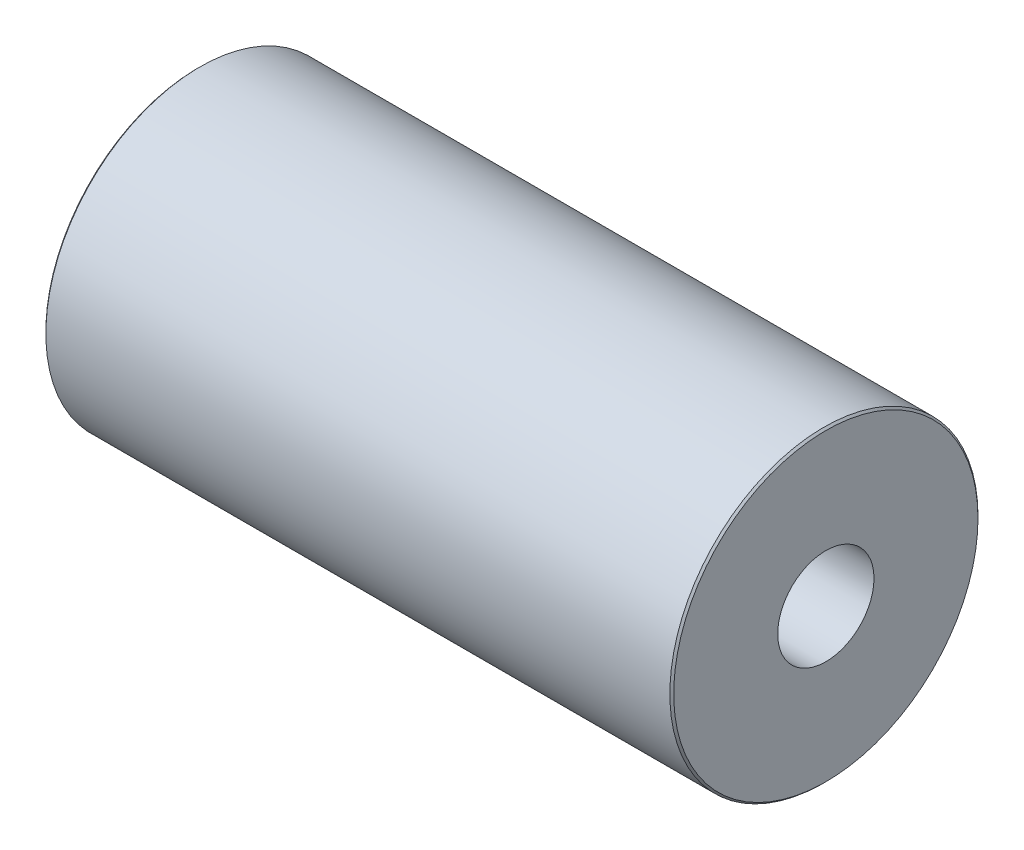
ISO-10303-21;
HEADER;
FILE_DESCRIPTION(('STEP AP214'),'2;1');
FILE_NAME('part.step','',(''),(''),'','','');
FILE_SCHEMA(('AUTOMOTIVE_DESIGN { 1 0 10303 214 1 1 1 1 }'));
ENDSEC;
DATA;
#1=APPLICATION_CONTEXT('core data for automotive mechanical design processes');
#2=APPLICATION_PROTOCOL_DEFINITION('international standard','automotive_design',2000,#1);
#3=PRODUCT_CONTEXT('',#1,'mechanical');
#4=PRODUCT('Part','Part','',(#3));
#5=PRODUCT_RELATED_PRODUCT_CATEGORY('part','',(#4));
#6=PRODUCT_DEFINITION_FORMATION('','',#4);
#7=PRODUCT_DEFINITION_CONTEXT('part definition',#1,'design');
#8=PRODUCT_DEFINITION('design','',#6,#7);
#9=PRODUCT_DEFINITION_SHAPE('','',#8);
#10=(LENGTH_UNIT() NAMED_UNIT(*) SI_UNIT(.MILLI.,.METRE.));
#11=(NAMED_UNIT(*) PLANE_ANGLE_UNIT() SI_UNIT($,.RADIAN.));
#12=(NAMED_UNIT(*) SI_UNIT($,.STERADIAN.) SOLID_ANGLE_UNIT());
#13=UNCERTAINTY_MEASURE_WITH_UNIT(LENGTH_MEASURE(1.E-05),#10,'distance_accuracy_value','');
#14=(GEOMETRIC_REPRESENTATION_CONTEXT(3) GLOBAL_UNCERTAINTY_ASSIGNED_CONTEXT((#13)) GLOBAL_UNIT_ASSIGNED_CONTEXT((#10,
#11,#12)) REPRESENTATION_CONTEXT('',''));
#15=CARTESIAN_POINT('',(0.,0.,0.));
#16=DIRECTION('',(0.,0.,1.));
#17=DIRECTION('',(1.,0.,0.));
#18=AXIS2_PLACEMENT_3D('',#15,#16,#17);
#19=CARTESIAN_POINT('',(16.3,0.,0.));
#20=DIRECTION('',(-1.,0.,0.));
#21=DIRECTION('',(0.,0.,1.));
#22=AXIS2_PLACEMENT_3D('',#19,#20,#21);
#23=CYLINDRICAL_SURFACE('',#22,8.);
#24=CARTESIAN_POINT('',(-16.2,0.,0.));
#25=DIRECTION('',(1.,0.,0.));
#26=DIRECTION('',(0.,0.,-1.));
#27=AXIS2_PLACEMENT_3D('',#24,#25,#26);
#28=CIRCLE('',#27,8.);
#29=CARTESIAN_POINT('',(-16.2,0.,-8.));
#30=VERTEX_POINT('',#29);
#31=EDGE_CURVE('E79',#30,#30,#28,.T.);
#32=ORIENTED_EDGE('',*,*,#31,.T.);
#33=EDGE_LOOP('',(#32));
#34=FACE_BOUND('',#33,.T.);
#35=CARTESIAN_POINT('',(16.2,0.,0.));
#36=DIRECTION('',(1.,0.,0.));
#37=DIRECTION('',(0.,0.,-1.));
#38=AXIS2_PLACEMENT_3D('',#35,#36,#37);
#39=CIRCLE('',#38,8.);
#40=CARTESIAN_POINT('',(16.2,0.,-8.));
#41=VERTEX_POINT('',#40);
#42=EDGE_CURVE('E76',#41,#41,#39,.F.);
#43=ORIENTED_EDGE('',*,*,#42,.T.);
#44=EDGE_LOOP('',(#43));
#45=FACE_BOUND('',#44,.T.);
#46=ADVANCED_FACE('F40',(#34,#45),#23,.T.);
#47=CARTESIAN_POINT('',(16.3,0.,0.));
#48=DIRECTION('',(1.,0.,0.));
#49=DIRECTION('',(0.,0.,-1.));
#50=AXIS2_PLACEMENT_3D('',#47,#48,#49);
#51=PLANE('',#50);
#52=CARTESIAN_POINT('',(16.3,0.,0.));
#53=DIRECTION('',(1.,0.,0.));
#54=DIRECTION('',(0.,0.,-1.));
#55=AXIS2_PLACEMENT_3D('',#52,#53,#54);
#56=CIRCLE('',#55,7.9);
#57=CARTESIAN_POINT('',(16.3,0.,-7.9));
#58=VERTEX_POINT('',#57);
#59=EDGE_CURVE('E11',#58,#58,#56,.T.);
#60=ORIENTED_EDGE('',*,*,#59,.T.);
#61=EDGE_LOOP('',(#60));
#62=FACE_BOUND('',#61,.T.);
#63=CARTESIAN_POINT('',(16.3,0.,0.));
#64=DIRECTION('',(1.,0.,0.));
#65=DIRECTION('',(0.,0.,-1.));
#66=AXIS2_PLACEMENT_3D('',#63,#64,#65);
#67=CIRCLE('',#66,2.49999999999999);
#68=CARTESIAN_POINT('',(16.3,0.,-2.49999999999999));
#69=VERTEX_POINT('',#68);
#70=EDGE_CURVE('E66',#69,#69,#67,.T.);
#71=ORIENTED_EDGE('',*,*,#70,.F.);
#72=EDGE_LOOP('',(#71));
#73=FACE_BOUND('',#72,.T.);
#74=ADVANCED_FACE('F94',(#62,#73),#51,.T.);
#75=CARTESIAN_POINT('',(-16.3,0.,0.));
#76=DIRECTION('',(1.,0.,0.));
#77=DIRECTION('',(0.,0.,-1.));
#78=AXIS2_PLACEMENT_3D('',#75,#76,#77);
#79=PLANE('',#78);
#80=CARTESIAN_POINT('',(-16.3,0.,0.));
#81=DIRECTION('',(1.,0.,0.));
#82=DIRECTION('',(0.,0.,-1.));
#83=AXIS2_PLACEMENT_3D('',#80,#81,#82);
#84=CIRCLE('',#83,7.9);
#85=CARTESIAN_POINT('',(-16.3,0.,-7.9));
#86=VERTEX_POINT('',#85);
#87=EDGE_CURVE('E49',#86,#86,#84,.F.);
#88=ORIENTED_EDGE('',*,*,#87,.T.);
#89=EDGE_LOOP('',(#88));
#90=FACE_BOUND('',#89,.T.);
#91=CARTESIAN_POINT('',(-16.3,0.,0.));
#92=DIRECTION('',(-1.,0.,0.));
#93=DIRECTION('',(0.,0.,1.));
#94=AXIS2_PLACEMENT_3D('',#91,#92,#93);
#95=CIRCLE('',#94,2.49999999999999);
#96=CARTESIAN_POINT('',(-16.3,0.,2.49999999999999));
#97=VERTEX_POINT('',#96);
#98=EDGE_CURVE('E65',#97,#97,#95,.T.);
#99=ORIENTED_EDGE('',*,*,#98,.F.);
#100=EDGE_LOOP('',(#99));
#101=FACE_BOUND('',#100,.T.);
#102=ADVANCED_FACE('F84',(#90,#101),#79,.F.);
#103=CARTESIAN_POINT('',(-6.3,0.,0.));
#104=DIRECTION('',(-1.,0.,0.));
#105=DIRECTION('',(0.,0.,1.));
#106=AXIS2_PLACEMENT_3D('',#103,#104,#105);
#107=CONICAL_SURFACE('',#106,2.5,1.02974425867665);
#108=CARTESIAN_POINT('',(-4.7978484524311,0.,0.));
#109=VERTEX_POINT('',#108);
#110=VERTEX_LOOP('',#109);
#111=FACE_BOUND('',#110,.T.);
#112=CARTESIAN_POINT('',(-6.3,0.,0.));
#113=DIRECTION('',(-1.,0.,0.));
#114=DIRECTION('',(0.,0.,1.));
#115=AXIS2_PLACEMENT_3D('',#112,#113,#114);
#116=CIRCLE('',#115,2.5);
#117=CARTESIAN_POINT('',(-6.3,0.,2.5));
#118=VERTEX_POINT('',#117);
#119=EDGE_CURVE('E69',#118,#118,#116,.T.);
#120=ORIENTED_EDGE('',*,*,#119,.T.);
#121=EDGE_LOOP('',(#120));
#122=FACE_BOUND('',#121,.T.);
#123=ADVANCED_FACE('F114',(#111,#122),#107,.F.);
#124=CARTESIAN_POINT('',(-16.3,0.,0.));
#125=DIRECTION('',(-1.,0.,0.));
#126=DIRECTION('',(0.,0.,1.));
#127=AXIS2_PLACEMENT_3D('',#124,#125,#126);
#128=CYLINDRICAL_SURFACE('',#127,2.49999999999999);
#129=ORIENTED_EDGE('',*,*,#119,.F.);
#130=EDGE_LOOP('',(#129));
#131=FACE_BOUND('',#130,.T.);
#132=ORIENTED_EDGE('',*,*,#98,.T.);
#133=EDGE_LOOP('',(#132));
#134=FACE_BOUND('',#133,.T.);
#135=ADVANCED_FACE('F59',(#131,#134),#128,.F.);
#136=CARTESIAN_POINT('',(6.3,0.,0.));
#137=DIRECTION('',(1.,0.,0.));
#138=DIRECTION('',(0.,0.,-1.));
#139=AXIS2_PLACEMENT_3D('',#136,#137,#138);
#140=CONICAL_SURFACE('',#139,2.5,1.02974425867665);
#141=CARTESIAN_POINT('',(4.7978484524311,0.,0.));
#142=VERTEX_POINT('',#141);
#143=VERTEX_LOOP('',#142);
#144=FACE_BOUND('',#143,.T.);
#145=CARTESIAN_POINT('',(6.3,0.,0.));
#146=DIRECTION('',(1.,0.,0.));
#147=DIRECTION('',(0.,0.,-1.));
#148=AXIS2_PLACEMENT_3D('',#145,#146,#147);
#149=CIRCLE('',#148,2.5);
#150=CARTESIAN_POINT('',(6.3,0.,-2.5));
#151=VERTEX_POINT('',#150);
#152=EDGE_CURVE('E63',#151,#151,#149,.T.);
#153=ORIENTED_EDGE('',*,*,#152,.T.);
#154=EDGE_LOOP('',(#153));
#155=FACE_BOUND('',#154,.T.);
#156=ADVANCED_FACE('F55',(#144,#155),#140,.F.);
#157=CARTESIAN_POINT('',(16.3,0.,0.));
#158=DIRECTION('',(1.,0.,0.));
#159=DIRECTION('',(0.,0.,-1.));
#160=AXIS2_PLACEMENT_3D('',#157,#158,#159);
#161=CYLINDRICAL_SURFACE('',#160,2.49999999999999);
#162=ORIENTED_EDGE('',*,*,#152,.F.);
#163=EDGE_LOOP('',(#162));
#164=FACE_BOUND('',#163,.T.);
#165=ORIENTED_EDGE('',*,*,#70,.T.);
#166=EDGE_LOOP('',(#165));
#167=FACE_BOUND('',#166,.T.);
#168=ADVANCED_FACE('F58',(#164,#167),#161,.F.);
#169=CARTESIAN_POINT('',(-16.2,0.,0.));
#170=DIRECTION('',(1.,0.,0.));
#171=DIRECTION('',(0.,0.,-1.));
#172=AXIS2_PLACEMENT_3D('',#169,#170,#171);
#173=CONICAL_SURFACE('',#172,8.,0.785398163397431);
#174=ORIENTED_EDGE('',*,*,#87,.F.);
#175=EDGE_LOOP('',(#174));
#176=FACE_BOUND('',#175,.T.);
#177=ORIENTED_EDGE('',*,*,#31,.F.);
#178=EDGE_LOOP('',(#177));
#179=FACE_BOUND('',#178,.T.);
#180=ADVANCED_FACE('F87',(#176,#179),#173,.T.);
#181=CARTESIAN_POINT('',(16.3,0.,0.));
#182=DIRECTION('',(-1.,0.,0.));
#183=DIRECTION('',(0.,0.,1.));
#184=AXIS2_PLACEMENT_3D('',#181,#182,#183);
#185=CONICAL_SURFACE('',#184,7.9,0.785398163397448);
#186=ORIENTED_EDGE('',*,*,#42,.F.);
#187=EDGE_LOOP('',(#186));
#188=FACE_BOUND('',#187,.T.);
#189=ORIENTED_EDGE('',*,*,#59,.F.);
#190=EDGE_LOOP('',(#189));
#191=FACE_BOUND('',#190,.T.);
#192=ADVANCED_FACE('F43',(#188,#191),#185,.T.);
#193=CLOSED_SHELL('',(#46,#74,#102,#123,#135,#156,#168,#180,#192));
#194=MANIFOLD_SOLID_BREP('B2',#193);
#195=ADVANCED_BREP_SHAPE_REPRESENTATION('',(#18,#194),#14);
#196=SHAPE_DEFINITION_REPRESENTATION(#9,#195);
ENDSEC;
END-ISO-10303-21;
